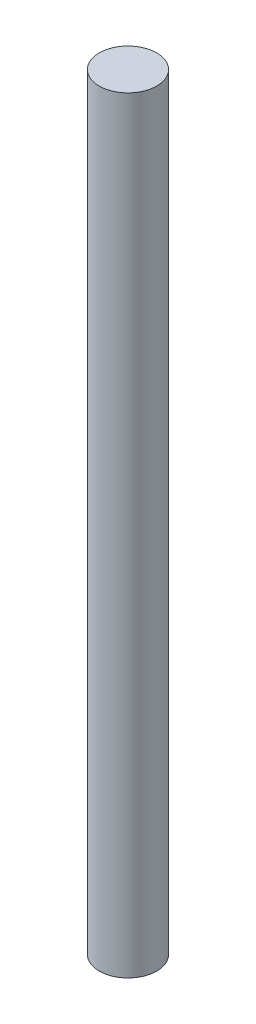
ISO-10303-21;
HEADER;
FILE_DESCRIPTION(('STEP AP214'),'2;1');
FILE_NAME('part.step','',(''),(''),'','','');
FILE_SCHEMA(('AUTOMOTIVE_DESIGN { 1 0 10303 214 1 1 1 1 }'));
ENDSEC;
DATA;
#1=APPLICATION_CONTEXT('core data for automotive mechanical design processes');
#2=APPLICATION_PROTOCOL_DEFINITION('international standard','automotive_design',2000,#1);
#3=PRODUCT_CONTEXT('',#1,'mechanical');
#4=PRODUCT('Part','Part','',(#3));
#5=PRODUCT_RELATED_PRODUCT_CATEGORY('part','',(#4));
#6=PRODUCT_DEFINITION_FORMATION('','',#4);
#7=PRODUCT_DEFINITION_CONTEXT('part definition',#1,'design');
#8=PRODUCT_DEFINITION('design','',#6,#7);
#9=PRODUCT_DEFINITION_SHAPE('','',#8);
#10=(LENGTH_UNIT() NAMED_UNIT(*) SI_UNIT(.MILLI.,.METRE.));
#11=(NAMED_UNIT(*) PLANE_ANGLE_UNIT() SI_UNIT($,.RADIAN.));
#12=(NAMED_UNIT(*) SI_UNIT($,.STERADIAN.) SOLID_ANGLE_UNIT());
#13=UNCERTAINTY_MEASURE_WITH_UNIT(LENGTH_MEASURE(1.E-05),#10,'distance_accuracy_value','');
#14=(GEOMETRIC_REPRESENTATION_CONTEXT(3) GLOBAL_UNCERTAINTY_ASSIGNED_CONTEXT((#13)) GLOBAL_UNIT_ASSIGNED_CONTEXT((#10,
#11,#12)) REPRESENTATION_CONTEXT('',''));
#15=CARTESIAN_POINT('',(0.,0.,0.));
#16=DIRECTION('',(0.,0.,1.));
#17=DIRECTION('',(1.,0.,0.));
#18=AXIS2_PLACEMENT_3D('',#15,#16,#17);
#19=CARTESIAN_POINT('',(0.,80.,0.));
#20=DIRECTION('',(0.,-1.,0.));
#21=DIRECTION('',(0.,0.,-1.));
#22=AXIS2_PLACEMENT_3D('',#19,#20,#21);
#23=CYLINDRICAL_SURFACE('',#22,3.);
#24=CARTESIAN_POINT('',(0.,80.,0.));
#25=DIRECTION('',(0.,1.,0.));
#26=DIRECTION('',(0.,0.,1.));
#27=AXIS2_PLACEMENT_3D('',#24,#25,#26);
#28=CIRCLE('',#27,3.);
#29=CARTESIAN_POINT('',(0.,80.,3.));
#30=VERTEX_POINT('',#29);
#31=EDGE_CURVE('E10',#30,#30,#28,.T.);
#32=ORIENTED_EDGE('',*,*,#31,.F.);
#33=EDGE_LOOP('',(#32));
#34=FACE_BOUND('',#33,.T.);
#35=CARTESIAN_POINT('',(0.,0.,0.));
#36=DIRECTION('',(0.,1.,0.));
#37=DIRECTION('',(0.,0.,1.));
#38=AXIS2_PLACEMENT_3D('',#35,#36,#37);
#39=CIRCLE('',#38,3.);
#40=CARTESIAN_POINT('',(0.,0.,3.));
#41=VERTEX_POINT('',#40);
#42=EDGE_CURVE('E33',#41,#41,#39,.T.);
#43=ORIENTED_EDGE('',*,*,#42,.T.);
#44=EDGE_LOOP('',(#43));
#45=FACE_BOUND('',#44,.T.);
#46=ADVANCED_FACE('F30',(#34,#45),#23,.T.);
#47=CARTESIAN_POINT('',(0.,80.,0.));
#48=DIRECTION('',(0.,1.,0.));
#49=DIRECTION('',(0.,0.,1.));
#50=AXIS2_PLACEMENT_3D('',#47,#48,#49);
#51=PLANE('',#50);
#52=ORIENTED_EDGE('',*,*,#31,.T.);
#53=EDGE_LOOP('',(#52));
#54=FACE_BOUND('',#53,.T.);
#55=ADVANCED_FACE('F45',(#54),#51,.T.);
#56=CARTESIAN_POINT('',(0.,0.,0.));
#57=DIRECTION('',(0.,1.,0.));
#58=DIRECTION('',(0.,0.,1.));
#59=AXIS2_PLACEMENT_3D('',#56,#57,#58);
#60=PLANE('',#59);
#61=ORIENTED_EDGE('',*,*,#42,.F.);
#62=EDGE_LOOP('',(#61));
#63=FACE_BOUND('',#62,.T.);
#64=ADVANCED_FACE('F43',(#63),#60,.F.);
#65=CLOSED_SHELL('',(#46,#55,#64));
#66=MANIFOLD_SOLID_BREP('B2',#65);
#67=ADVANCED_BREP_SHAPE_REPRESENTATION('',(#18,#66),#14);
#68=SHAPE_DEFINITION_REPRESENTATION(#9,#67);
ENDSEC;
END-ISO-10303-21;
